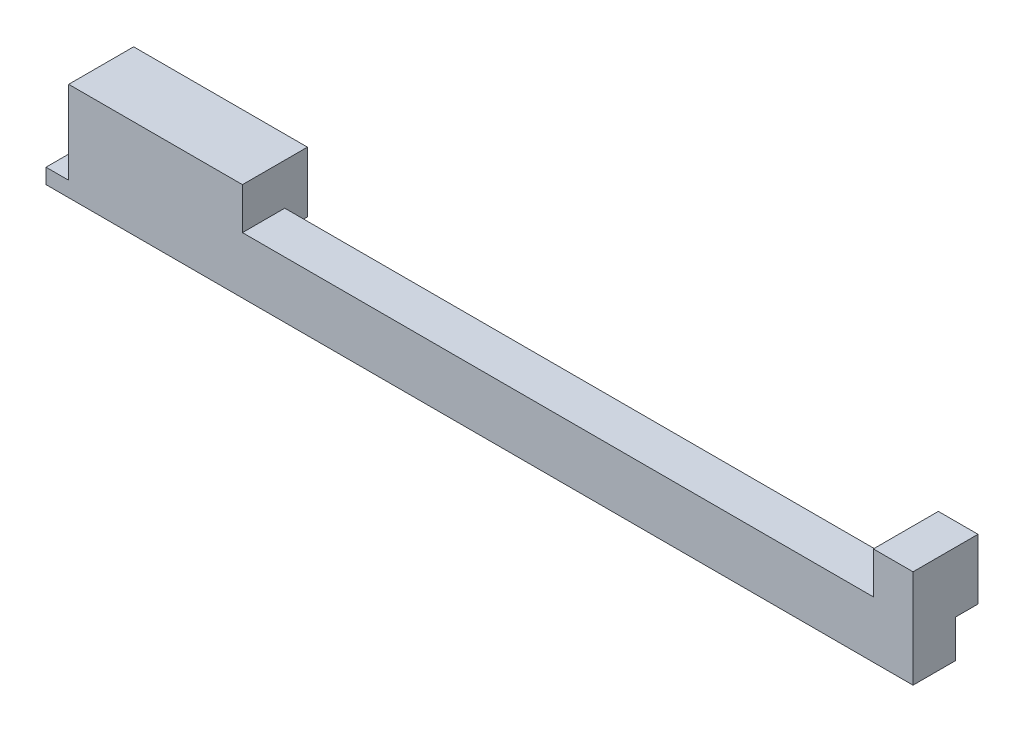
ISO-10303-21;
HEADER;
FILE_DESCRIPTION(('STEP AP214'),'2;1');
FILE_NAME('part.step','',(''),(''),'','','');
FILE_SCHEMA(('AUTOMOTIVE_DESIGN { 1 0 10303 214 1 1 1 1 }'));
ENDSEC;
DATA;
#1=APPLICATION_CONTEXT('core data for automotive mechanical design processes');
#2=APPLICATION_PROTOCOL_DEFINITION('international standard','automotive_design',2000,#1);
#3=PRODUCT_CONTEXT('',#1,'mechanical');
#4=PRODUCT('Part','Part','',(#3));
#5=PRODUCT_RELATED_PRODUCT_CATEGORY('part','',(#4));
#6=PRODUCT_DEFINITION_FORMATION('','',#4);
#7=PRODUCT_DEFINITION_CONTEXT('part definition',#1,'design');
#8=PRODUCT_DEFINITION('design','',#6,#7);
#9=PRODUCT_DEFINITION_SHAPE('','',#8);
#10=(LENGTH_UNIT() NAMED_UNIT(*) SI_UNIT(.MILLI.,.METRE.));
#11=(NAMED_UNIT(*) PLANE_ANGLE_UNIT() SI_UNIT($,.RADIAN.));
#12=(NAMED_UNIT(*) SI_UNIT($,.STERADIAN.) SOLID_ANGLE_UNIT());
#13=UNCERTAINTY_MEASURE_WITH_UNIT(LENGTH_MEASURE(1.E-05),#10,'distance_accuracy_value','');
#14=(GEOMETRIC_REPRESENTATION_CONTEXT(3) GLOBAL_UNCERTAINTY_ASSIGNED_CONTEXT((#13)) GLOBAL_UNIT_ASSIGNED_CONTEXT((#10,
#11,#12)) REPRESENTATION_CONTEXT('',''));
#15=CARTESIAN_POINT('',(0.,0.,0.));
#16=DIRECTION('',(0.,0.,1.));
#17=DIRECTION('',(1.,0.,0.));
#18=AXIS2_PLACEMENT_3D('',#15,#16,#17);
#19=CARTESIAN_POINT('',(0.,173.602166940836,0.));
#20=DIRECTION('',(0.,1.,0.));
#21=DIRECTION('',(0.,0.,1.));
#22=AXIS2_PLACEMENT_3D('',#19,#20,#21);
#23=PLANE('',#22);
#24=DIRECTION('',(1.,0.,0.));
#25=VECTOR('',#24,1.);
#26=CARTESIAN_POINT('',(-180.666732553835,173.602166940836,8.66482688049147));
#27=LINE('',#26,#25);
#28=CARTESIAN_POINT('',(-180.666732553835,173.602166940836,8.66482688049147));
#29=VERTEX_POINT('',#28);
#30=CARTESIAN_POINT('',(-175.666732553835,173.602166940836,8.66482688049147));
#31=VERTEX_POINT('',#30);
#32=EDGE_CURVE('E47',#29,#31,#27,.T.);
#33=ORIENTED_EDGE('',*,*,#32,.T.);
#34=DIRECTION('',(0.,0.,-1.));
#35=VECTOR('',#34,1.);
#36=CARTESIAN_POINT('',(-175.666732553834,173.602166940836,12.6648268804915));
#37=LINE('',#36,#35);
#38=CARTESIAN_POINT('',(-175.666732553834,173.602166940836,4.33149354715814));
#39=VERTEX_POINT('',#38);
#40=EDGE_CURVE('E52',#31,#39,#37,.T.);
#41=ORIENTED_EDGE('',*,*,#40,.T.);
#42=DIRECTION('',(-1.,0.,0.));
#43=VECTOR('',#42,1.);
#44=CARTESIAN_POINT('',(45.1666007794988,173.602166940836,4.33149354715814));
#45=LINE('',#44,#43);
#46=CARTESIAN_POINT('',(10.5832674461655,173.602166940836,4.33149354715814));
#47=VERTEX_POINT('',#46);
#48=EDGE_CURVE('E268',#47,#39,#45,.T.);
#49=ORIENTED_EDGE('',*,*,#48,.F.);
#50=DIRECTION('',(0.,0.,1.));
#51=VECTOR('',#50,1.);
#52=CARTESIAN_POINT('',(10.5832674461655,173.602166940836,4.33149354715814));
#53=LINE('',#52,#51);
#54=CARTESIAN_POINT('',(10.5832674461655,173.602166940836,13.6648268804915));
#55=VERTEX_POINT('',#54);
#56=EDGE_CURVE('E11',#47,#55,#53,.T.);
#57=ORIENTED_EDGE('',*,*,#56,.T.);
#58=DIRECTION('',(1.,0.,0.));
#59=VECTOR('',#58,1.);
#60=CARTESIAN_POINT('',(45.1666007794988,173.602166940836,13.6648268804915));
#61=LINE('',#60,#59);
#62=CARTESIAN_POINT('',(-180.666732553835,173.602166940836,13.6648268804915));
#63=VERTEX_POINT('',#62);
#64=EDGE_CURVE('E66',#63,#55,#61,.T.);
#65=ORIENTED_EDGE('',*,*,#64,.F.);
#66=DIRECTION('',(0.,0.,1.));
#67=VECTOR('',#66,1.);
#68=CARTESIAN_POINT('',(-180.666732553835,173.602166940836,12.6648268804915));
#69=LINE('',#68,#67);
#70=EDGE_CURVE('E270',#29,#63,#69,.T.);
#71=ORIENTED_EDGE('',*,*,#70,.F.);
#72=EDGE_LOOP('',(#33,#41,#49,#57,#65,#71));
#73=FACE_BOUND('',#72,.T.);
#74=ADVANCED_FACE('F44',(#73),#23,.F.);
#75=CARTESIAN_POINT('',(-67.7500658871679,-43.0644997258313,-0.668506452841859));
#76=DIRECTION('',(0.,0.,1.));
#77=DIRECTION('',(0.,-1.,0.));
#78=AXIS2_PLACEMENT_3D('',#75,#76,#77);
#79=PLANE('',#78);
#80=DIRECTION('',(-1.,0.,0.));
#81=VECTOR('',#80,1.);
#82=CARTESIAN_POINT('',(-67.7500658871679,181.935500274169,-0.668506452841859));
#83=LINE('',#82,#81);
#84=CARTESIAN_POINT('',(-137.333399220501,181.935500274169,-0.668506452841859));
#85=VERTEX_POINT('',#84);
#86=CARTESIAN_POINT('',(-173.746119425869,181.935500274169,-0.668506452841859));
#87=VERTEX_POINT('',#86);
#88=EDGE_CURVE('E239',#85,#87,#83,.T.);
#89=ORIENTED_EDGE('',*,*,#88,.T.);
#90=DIRECTION('',(-0.692646888854002,-0.721276845157858,0.));
#91=VECTOR('',#90,1.);
#92=CARTESIAN_POINT('',(-173.746119425869,181.935500274169,-0.668506452841859));
#93=LINE('',#92,#91);
#94=CARTESIAN_POINT('',(-175.666732553835,179.935500274169,-0.668506452841859));
#95=VERTEX_POINT('',#94);
#96=EDGE_CURVE('E295',#87,#95,#93,.T.);
#97=ORIENTED_EDGE('',*,*,#96,.T.);
#98=DIRECTION('',(0.,-1.,0.));
#99=VECTOR('',#98,1.);
#100=CARTESIAN_POINT('',(-175.666732553835,-43.0644997258311,-0.668506452841859));
#101=LINE('',#100,#99);
#102=CARTESIAN_POINT('',(-175.666732553835,195.268833607502,-0.668506452841859));
#103=VERTEX_POINT('',#102);
#104=EDGE_CURVE('E348',#103,#95,#101,.T.);
#105=ORIENTED_EDGE('',*,*,#104,.F.);
#106=DIRECTION('',(-1.,0.,0.));
#107=VECTOR('',#106,1.);
#108=CARTESIAN_POINT('',(-67.7500658871679,195.268833607502,-0.668506452841859));
#109=LINE('',#108,#107);
#110=CARTESIAN_POINT('',(-137.333399220501,195.268833607502,-0.668506452841859));
#111=VERTEX_POINT('',#110);
#112=EDGE_CURVE('E296',#111,#103,#109,.T.);
#113=ORIENTED_EDGE('',*,*,#112,.F.);
#114=DIRECTION('',(0.,1.,0.));
#115=VECTOR('',#114,1.);
#116=CARTESIAN_POINT('',(-137.333399220501,-43.0644997258313,-0.668506452841859));
#117=LINE('',#116,#115);
#118=EDGE_CURVE('E193',#85,#111,#117,.T.);
#119=ORIENTED_EDGE('',*,*,#118,.F.);
#120=EDGE_LOOP('',(#89,#97,#105,#113,#119));
#121=FACE_BOUND('',#120,.T.);
#122=ADVANCED_FACE('F349',(#121),#79,.F.);
#123=CARTESIAN_POINT('',(-180.666732553835,-43.0644997258311,8.66482688049147));
#124=DIRECTION('',(0.,0.,-1.));
#125=DIRECTION('',(0.,-1.,0.));
#126=AXIS2_PLACEMENT_3D('',#123,#124,#125);
#127=PLANE('',#126);
#128=ORIENTED_EDGE('',*,*,#32,.F.);
#129=DIRECTION('',(0.,-1.,0.));
#130=VECTOR('',#129,1.);
#131=CARTESIAN_POINT('',(-180.666732553835,176.935500274169,8.66482688049147));
#132=LINE('',#131,#130);
#133=CARTESIAN_POINT('',(-180.666732553835,176.935500274169,8.66482688049147));
#134=VERTEX_POINT('',#133);
#135=EDGE_CURVE('E249',#134,#29,#132,.T.);
#136=ORIENTED_EDGE('',*,*,#135,.F.);
#137=DIRECTION('',(-1.,0.,0.));
#138=VECTOR('',#137,1.);
#139=CARTESIAN_POINT('',(-180.666732553835,176.935500274169,8.66482688049147));
#140=LINE('',#139,#138);
#141=CARTESIAN_POINT('',(-175.666732553835,176.935500274169,8.66482688049147));
#142=VERTEX_POINT('',#141);
#143=EDGE_CURVE('E245',#142,#134,#140,.T.);
#144=ORIENTED_EDGE('',*,*,#143,.F.);
#145=DIRECTION('',(0.,1.,0.));
#146=VECTOR('',#145,1.);
#147=CARTESIAN_POINT('',(-175.666732553835,176.935500274169,8.66482688049147));
#148=LINE('',#147,#146);
#149=EDGE_CURVE('E225',#31,#142,#148,.T.);
#150=ORIENTED_EDGE('',*,*,#149,.F.);
#151=EDGE_LOOP('',(#128,#136,#144,#150));
#152=FACE_BOUND('',#151,.T.);
#153=ADVANCED_FACE('F283',(#152),#127,.T.);
#154=CARTESIAN_POINT('',(-180.666732553835,-43.0644997258311,12.6648268804915));
#155=DIRECTION('',(1.,0.,0.));
#156=DIRECTION('',(0.,1.,0.));
#157=AXIS2_PLACEMENT_3D('',#154,#155,#156);
#158=PLANE('',#157);
#159=ORIENTED_EDGE('',*,*,#135,.T.);
#160=ORIENTED_EDGE('',*,*,#70,.T.);
#161=DIRECTION('',(0.,-1.,0.));
#162=VECTOR('',#161,1.);
#163=CARTESIAN_POINT('',(-180.666732553835,-33.0644997258311,13.6648268804915));
#164=LINE('',#163,#162);
#165=CARTESIAN_POINT('',(-180.666732553835,176.935500274169,13.6648268804915));
#166=VERTEX_POINT('',#165);
#167=EDGE_CURVE('E324',#166,#63,#164,.T.);
#168=ORIENTED_EDGE('',*,*,#167,.F.);
#169=DIRECTION('',(0.,0.,-1.));
#170=VECTOR('',#169,1.);
#171=CARTESIAN_POINT('',(-180.666732553835,176.935500274169,12.6648268804915));
#172=LINE('',#171,#170);
#173=EDGE_CURVE('E217',#166,#134,#172,.T.);
#174=ORIENTED_EDGE('',*,*,#173,.T.);
#175=EDGE_LOOP('',(#159,#160,#168,#174));
#176=FACE_BOUND('',#175,.T.);
#177=ADVANCED_FACE('F370',(#176),#158,.F.);
#178=CARTESIAN_POINT('',(-180.666732553835,176.935500274169,12.6648268804915));
#179=DIRECTION('',(0.,-1.,0.));
#180=DIRECTION('',(0.,0.,-1.));
#181=AXIS2_PLACEMENT_3D('',#178,#179,#180);
#182=PLANE('',#181);
#183=ORIENTED_EDGE('',*,*,#143,.T.);
#184=ORIENTED_EDGE('',*,*,#173,.F.);
#185=DIRECTION('',(-1.,0.,0.));
#186=VECTOR('',#185,1.);
#187=CARTESIAN_POINT('',(-180.666732553835,176.935500274169,13.6648268804915));
#188=LINE('',#187,#186);
#189=CARTESIAN_POINT('',(-175.666732553835,176.935500274169,13.6648268804915));
#190=VERTEX_POINT('',#189);
#191=EDGE_CURVE('E248',#190,#166,#188,.T.);
#192=ORIENTED_EDGE('',*,*,#191,.F.);
#193=DIRECTION('',(0.,0.,-1.));
#194=VECTOR('',#193,1.);
#195=CARTESIAN_POINT('',(-175.666732553835,176.935500274169,12.6648268804915));
#196=LINE('',#195,#194);
#197=EDGE_CURVE('E220',#190,#142,#196,.T.);
#198=ORIENTED_EDGE('',*,*,#197,.T.);
#199=EDGE_LOOP('',(#183,#184,#192,#198));
#200=FACE_BOUND('',#199,.T.);
#201=ADVANCED_FACE('F372',(#200),#182,.F.);
#202=CARTESIAN_POINT('',(-180.666732553835,195.268833607502,12.6648268804915));
#203=DIRECTION('',(0.,-1.,0.));
#204=DIRECTION('',(0.,0.,-1.));
#205=AXIS2_PLACEMENT_3D('',#202,#203,#204);
#206=PLANE('',#205);
#207=DIRECTION('',(0.,0.,-1.));
#208=VECTOR('',#207,1.);
#209=CARTESIAN_POINT('',(-137.333399220501,195.268833607502,75.1807564618534));
#210=LINE('',#209,#208);
#211=CARTESIAN_POINT('',(-137.333399220501,195.268833607502,13.6648268804915));
#212=VERTEX_POINT('',#211);
#213=EDGE_CURVE('E305',#212,#111,#210,.T.);
#214=ORIENTED_EDGE('',*,*,#213,.T.);
#215=ORIENTED_EDGE('',*,*,#112,.T.);
#216=DIRECTION('',(0.,0.,-1.));
#217=VECTOR('',#216,1.);
#218=CARTESIAN_POINT('',(-175.666732553835,195.268833607502,12.6648268804915));
#219=LINE('',#218,#217);
#220=CARTESIAN_POINT('',(-175.666732553835,195.268833607502,13.6648268804915));
#221=VERTEX_POINT('',#220);
#222=EDGE_CURVE('E300',#221,#103,#219,.T.);
#223=ORIENTED_EDGE('',*,*,#222,.F.);
#224=DIRECTION('',(-1.,0.,0.));
#225=VECTOR('',#224,1.);
#226=CARTESIAN_POINT('',(-175.666732553835,195.268833607502,13.6648268804915));
#227=LINE('',#226,#225);
#228=EDGE_CURVE('E292',#212,#221,#227,.T.);
#229=ORIENTED_EDGE('',*,*,#228,.F.);
#230=EDGE_LOOP('',(#214,#215,#223,#229));
#231=FACE_BOUND('',#230,.T.);
#232=ADVANCED_FACE('F342',(#231),#206,.F.);
#233=CARTESIAN_POINT('',(-67.7500658871679,-43.0644997258313,-0.668506452841859));
#234=DIRECTION('',(0.,0.,1.));
#235=DIRECTION('',(0.,-1.,0.));
#236=AXIS2_PLACEMENT_3D('',#233,#234,#235);
#237=PLANE('',#236);
#238=DIRECTION('',(1.,0.,0.));
#239=VECTOR('',#238,1.);
#240=CARTESIAN_POINT('',(-67.7500658871679,195.268833607502,-0.668506452841859));
#241=LINE('',#240,#239);
#242=CARTESIAN_POINT('',(1.83326744616545,195.268833607502,-0.668506452841859));
#243=VERTEX_POINT('',#242);
#244=CARTESIAN_POINT('',(10.5832674461654,195.268833607502,-0.668506452841859));
#245=VERTEX_POINT('',#244);
#246=EDGE_CURVE('E230',#243,#245,#241,.T.);
#247=ORIENTED_EDGE('',*,*,#246,.T.);
#248=DIRECTION('',(0.,-1.,0.));
#249=VECTOR('',#248,1.);
#250=CARTESIAN_POINT('',(10.5832674461654,-43.0644997258313,-0.668506452841859));
#251=LINE('',#250,#249);
#252=CARTESIAN_POINT('',(10.5832674461655,181.935500274169,-0.668506452841859));
#253=VERTEX_POINT('',#252);
#254=EDGE_CURVE('E263',#245,#253,#251,.T.);
#255=ORIENTED_EDGE('',*,*,#254,.T.);
#256=DIRECTION('',(1.,0.,0.));
#257=VECTOR('',#256,1.);
#258=CARTESIAN_POINT('',(-67.7500658871679,181.935500274169,-0.668506452841859));
#259=LINE('',#258,#257);
#260=CARTESIAN_POINT('',(1.83326744616545,181.935500274169,-0.668506452841859));
#261=VERTEX_POINT('',#260);
#262=EDGE_CURVE('E301',#261,#253,#259,.T.);
#263=ORIENTED_EDGE('',*,*,#262,.F.);
#264=DIRECTION('',(0.,1.,0.));
#265=VECTOR('',#264,1.);
#266=CARTESIAN_POINT('',(1.83326744616545,-43.0644997258313,-0.668506452841859));
#267=LINE('',#266,#265);
#268=EDGE_CURVE('E228',#261,#243,#267,.T.);
#269=ORIENTED_EDGE('',*,*,#268,.T.);
#270=EDGE_LOOP('',(#247,#255,#263,#269));
#271=FACE_BOUND('',#270,.T.);
#272=ADVANCED_FACE('F394',(#271),#237,.F.);
#273=CARTESIAN_POINT('',(1.83326744616545,-43.0644997258311,75.1807564618534));
#274=DIRECTION('',(1.,0.,0.));
#275=DIRECTION('',(0.,0.,-1.));
#276=AXIS2_PLACEMENT_3D('',#273,#274,#275);
#277=PLANE('',#276);
#278=DIRECTION('',(0.,-1.,0.));
#279=VECTOR('',#278,1.);
#280=CARTESIAN_POINT('',(1.83326744616545,-43.0644997258311,4.33149354715814));
#281=LINE('',#280,#279);
#282=CARTESIAN_POINT('',(1.83326744616545,186.102166940836,4.33149354715814));
#283=VERTEX_POINT('',#282);
#284=CARTESIAN_POINT('',(1.83326744616545,181.935500274169,4.33149354715816));
#285=VERTEX_POINT('',#284);
#286=EDGE_CURVE('E204',#283,#285,#281,.T.);
#287=ORIENTED_EDGE('',*,*,#286,.F.);
#288=DIRECTION('',(0.,0.,-1.));
#289=VECTOR('',#288,1.);
#290=CARTESIAN_POINT('',(1.83326744616545,186.102166940836,13.6648268804915));
#291=LINE('',#290,#289);
#292=CARTESIAN_POINT('',(1.83326744616545,186.102166940836,13.6648268804915));
#293=VERTEX_POINT('',#292);
#294=EDGE_CURVE('E199',#293,#283,#291,.T.);
#295=ORIENTED_EDGE('',*,*,#294,.F.);
#296=DIRECTION('',(0.,-1.,0.));
#297=VECTOR('',#296,1.);
#298=CARTESIAN_POINT('',(1.83326744616545,188.602166940836,13.6648268804915));
#299=LINE('',#298,#297);
#300=CARTESIAN_POINT('',(1.83326744616545,195.268833607502,13.6648268804915));
#301=VERTEX_POINT('',#300);
#302=EDGE_CURVE('E227',#301,#293,#299,.T.);
#303=ORIENTED_EDGE('',*,*,#302,.F.);
#304=DIRECTION('',(0.,0.,-1.));
#305=VECTOR('',#304,1.);
#306=CARTESIAN_POINT('',(1.83326744616545,195.268833607502,75.1807564618534));
#307=LINE('',#306,#305);
#308=EDGE_CURVE('E250',#301,#243,#307,.T.);
#309=ORIENTED_EDGE('',*,*,#308,.T.);
#310=ORIENTED_EDGE('',*,*,#268,.F.);
#311=DIRECTION('',(0.,0.,-1.));
#312=VECTOR('',#311,1.);
#313=CARTESIAN_POINT('',(1.83326744616545,181.935500274169,75.1807564618534));
#314=LINE('',#313,#312);
#315=EDGE_CURVE('E254',#285,#261,#314,.T.);
#316=ORIENTED_EDGE('',*,*,#315,.F.);
#317=EDGE_LOOP('',(#287,#295,#303,#309,#310,#316));
#318=FACE_BOUND('',#317,.T.);
#319=ADVANCED_FACE('F390',(#318),#277,.F.);
#320=CARTESIAN_POINT('',(45.1666007794988,186.102166940836,4.33149354715814));
#321=DIRECTION('',(0.,-1.,0.));
#322=DIRECTION('',(0.,0.,-1.));
#323=AXIS2_PLACEMENT_3D('',#320,#321,#322);
#324=PLANE('',#323);
#325=DIRECTION('',(0.,0.,1.));
#326=VECTOR('',#325,1.);
#327=CARTESIAN_POINT('',(-137.333399220501,186.102166940836,13.6648268804915));
#328=LINE('',#327,#326);
#329=CARTESIAN_POINT('',(-137.333399220501,186.102166940836,4.33149354715814));
#330=VERTEX_POINT('',#329);
#331=CARTESIAN_POINT('',(-137.333399220501,186.102166940836,13.6648268804915));
#332=VERTEX_POINT('',#331);
#333=EDGE_CURVE('E183',#330,#332,#328,.T.);
#334=ORIENTED_EDGE('',*,*,#333,.T.);
#335=DIRECTION('',(1.,0.,0.));
#336=VECTOR('',#335,1.);
#337=CARTESIAN_POINT('',(-137.333399220501,186.102166940836,13.6648268804915));
#338=LINE('',#337,#336);
#339=EDGE_CURVE('E258',#332,#293,#338,.T.);
#340=ORIENTED_EDGE('',*,*,#339,.T.);
#341=ORIENTED_EDGE('',*,*,#294,.T.);
#342=DIRECTION('',(-1.,0.,0.));
#343=VECTOR('',#342,1.);
#344=CARTESIAN_POINT('',(-137.333399220501,186.102166940836,4.33149354715814));
#345=LINE('',#344,#343);
#346=EDGE_CURVE('E196',#283,#330,#345,.T.);
#347=ORIENTED_EDGE('',*,*,#346,.T.);
#348=EDGE_LOOP('',(#334,#340,#341,#347));
#349=FACE_BOUND('',#348,.T.);
#350=ADVANCED_FACE('F197',(#349),#324,.F.);
#351=CARTESIAN_POINT('',(-137.333399220501,-43.0644997258311,75.1807564618534));
#352=DIRECTION('',(-1.,0.,0.));
#353=DIRECTION('',(0.,0.,1.));
#354=AXIS2_PLACEMENT_3D('',#351,#352,#353);
#355=PLANE('',#354);
#356=ORIENTED_EDGE('',*,*,#333,.F.);
#357=DIRECTION('',(0.,-1.,0.));
#358=VECTOR('',#357,1.);
#359=CARTESIAN_POINT('',(-137.333399220501,-43.0644997258311,4.33149354715814));
#360=LINE('',#359,#358);
#361=CARTESIAN_POINT('',(-137.333399220501,181.935500274169,4.33149354715816));
#362=VERTEX_POINT('',#361);
#363=EDGE_CURVE('E188',#330,#362,#360,.T.);
#364=ORIENTED_EDGE('',*,*,#363,.T.);
#365=DIRECTION('',(0.,0.,-1.));
#366=VECTOR('',#365,1.);
#367=CARTESIAN_POINT('',(-137.333399220501,181.935500274169,75.1807564618534));
#368=LINE('',#367,#366);
#369=EDGE_CURVE('E243',#362,#85,#368,.T.);
#370=ORIENTED_EDGE('',*,*,#369,.T.);
#371=ORIENTED_EDGE('',*,*,#118,.T.);
#372=ORIENTED_EDGE('',*,*,#213,.F.);
#373=DIRECTION('',(0.,1.,0.));
#374=VECTOR('',#373,1.);
#375=CARTESIAN_POINT('',(-137.333399220501,195.268833607502,13.6648268804915));
#376=LINE('',#375,#374);
#377=EDGE_CURVE('E190',#332,#212,#376,.T.);
#378=ORIENTED_EDGE('',*,*,#377,.F.);
#379=EDGE_LOOP('',(#356,#364,#370,#371,#372,#378));
#380=FACE_BOUND('',#379,.T.);
#381=ADVANCED_FACE('F185',(#380),#355,.F.);
#382=CARTESIAN_POINT('',(-67.7500658871679,181.935500274169,4.33149354715814));
#383=DIRECTION('',(0.,-1.,0.));
#384=DIRECTION('',(-1.,0.,0.));
#385=AXIS2_PLACEMENT_3D('',#382,#383,#384);
#386=PLANE('',#385);
#387=ORIENTED_EDGE('',*,*,#88,.F.);
#388=ORIENTED_EDGE('',*,*,#369,.F.);
#389=DIRECTION('',(-1.,0.,0.));
#390=VECTOR('',#389,1.);
#391=CARTESIAN_POINT('',(-67.7500658871679,181.935500274169,4.33149354715814));
#392=LINE('',#391,#390);
#393=CARTESIAN_POINT('',(-173.746119425869,181.935500274169,4.33149354715814));
#394=VERTEX_POINT('',#393);
#395=EDGE_CURVE('E211',#362,#394,#392,.T.);
#396=ORIENTED_EDGE('',*,*,#395,.T.);
#397=DIRECTION('',(0.,0.,1.));
#398=VECTOR('',#397,1.);
#399=CARTESIAN_POINT('',(-173.746119425869,181.935500274169,-3.44136685093544));
#400=LINE('',#399,#398);
#401=EDGE_CURVE('E321',#87,#394,#400,.T.);
#402=ORIENTED_EDGE('',*,*,#401,.F.);
#403=EDGE_LOOP('',(#387,#388,#396,#402));
#404=FACE_BOUND('',#403,.T.);
#405=ADVANCED_FACE('F377',(#404),#386,.T.);
#406=CARTESIAN_POINT('',(-173.746119425869,181.935500274169,-3.44136685093544));
#407=DIRECTION('',(-0.721276845157858,0.692646888854002,0.));
#408=DIRECTION('',(0.,0.,1.));
#409=AXIS2_PLACEMENT_3D('',#406,#407,#408);
#410=PLANE('',#409);
#411=ORIENTED_EDGE('',*,*,#401,.T.);
#412=DIRECTION('',(0.692646888854002,0.721276845157858,0.));
#413=VECTOR('',#412,1.);
#414=CARTESIAN_POINT('',(-173.746119425869,181.935500274169,4.33149354715814));
#415=LINE('',#414,#413);
#416=CARTESIAN_POINT('',(-175.666732553835,179.935500274169,4.33149354715814));
#417=VERTEX_POINT('',#416);
#418=EDGE_CURVE('E235',#417,#394,#415,.T.);
#419=ORIENTED_EDGE('',*,*,#418,.F.);
#420=DIRECTION('',(0.,0.,1.));
#421=VECTOR('',#420,1.);
#422=CARTESIAN_POINT('',(-175.666732553835,179.935500274169,-3.44136685093544));
#423=LINE('',#422,#421);
#424=EDGE_CURVE('E244',#95,#417,#423,.T.);
#425=ORIENTED_EDGE('',*,*,#424,.F.);
#426=ORIENTED_EDGE('',*,*,#96,.F.);
#427=EDGE_LOOP('',(#411,#419,#425,#426));
#428=FACE_BOUND('',#427,.T.);
#429=ADVANCED_FACE('F380',(#428),#410,.F.);
#430=CARTESIAN_POINT('',(-175.666732553835,-43.0644997258311,12.6648268804915));
#431=DIRECTION('',(-1.,0.,0.));
#432=DIRECTION('',(0.,0.,1.));
#433=AXIS2_PLACEMENT_3D('',#430,#431,#432);
#434=PLANE('',#433);
#435=ORIENTED_EDGE('',*,*,#40,.F.);
#436=ORIENTED_EDGE('',*,*,#149,.T.);
#437=ORIENTED_EDGE('',*,*,#197,.F.);
#438=DIRECTION('',(0.,-1.,0.));
#439=VECTOR('',#438,1.);
#440=CARTESIAN_POINT('',(-175.666732553835,176.935500274169,13.6648268804915));
#441=LINE('',#440,#439);
#442=EDGE_CURVE('E224',#221,#190,#441,.T.);
#443=ORIENTED_EDGE('',*,*,#442,.F.);
#444=ORIENTED_EDGE('',*,*,#222,.T.);
#445=ORIENTED_EDGE('',*,*,#104,.T.);
#446=ORIENTED_EDGE('',*,*,#424,.T.);
#447=DIRECTION('',(0.,-1.,0.));
#448=VECTOR('',#447,1.);
#449=CARTESIAN_POINT('',(-175.666732553835,-43.0644997258311,4.33149354715814));
#450=LINE('',#449,#448);
#451=EDGE_CURVE('E238',#417,#39,#450,.T.);
#452=ORIENTED_EDGE('',*,*,#451,.T.);
#453=EDGE_LOOP('',(#435,#436,#437,#443,#444,#445,#446,#452));
#454=FACE_BOUND('',#453,.T.);
#455=ADVANCED_FACE('F353',(#454),#434,.T.);
#456=CARTESIAN_POINT('',(-67.7500658871679,181.935500274169,4.33149354715814));
#457=DIRECTION('',(0.,-1.,0.));
#458=DIRECTION('',(0.,0.,-1.));
#459=AXIS2_PLACEMENT_3D('',#456,#457,#458);
#460=PLANE('',#459);
#461=DIRECTION('',(0.,0.,-1.));
#462=VECTOR('',#461,1.);
#463=CARTESIAN_POINT('',(10.5832674461655,181.935500274169,4.33149354715814));
#464=LINE('',#463,#462);
#465=CARTESIAN_POINT('',(10.5832674461654,181.935500274169,4.33149354715814));
#466=VERTEX_POINT('',#465);
#467=EDGE_CURVE('E259',#466,#253,#464,.T.);
#468=ORIENTED_EDGE('',*,*,#467,.F.);
#469=DIRECTION('',(1.,0.,0.));
#470=VECTOR('',#469,1.);
#471=CARTESIAN_POINT('',(-67.7500658871679,181.935500274169,4.33149354715814));
#472=LINE('',#471,#470);
#473=EDGE_CURVE('E311',#285,#466,#472,.T.);
#474=ORIENTED_EDGE('',*,*,#473,.F.);
#475=ORIENTED_EDGE('',*,*,#315,.T.);
#476=ORIENTED_EDGE('',*,*,#262,.T.);
#477=EDGE_LOOP('',(#468,#474,#475,#476));
#478=FACE_BOUND('',#477,.T.);
#479=ADVANCED_FACE('F398',(#478),#460,.T.);
#480=CARTESIAN_POINT('',(45.1666007794988,-43.0644997258311,4.33149354715814));
#481=DIRECTION('',(0.,0.,1.));
#482=DIRECTION('',(1.,0.,0.));
#483=AXIS2_PLACEMENT_3D('',#480,#481,#482);
#484=PLANE('',#483);
#485=DIRECTION('',(0.,-1.,0.));
#486=VECTOR('',#485,1.);
#487=CARTESIAN_POINT('',(10.5832674461654,-43.0644997258311,4.33149354715814));
#488=LINE('',#487,#486);
#489=EDGE_CURVE('E255',#466,#47,#488,.T.);
#490=ORIENTED_EDGE('',*,*,#489,.T.);
#491=ORIENTED_EDGE('',*,*,#48,.T.);
#492=ORIENTED_EDGE('',*,*,#451,.F.);
#493=ORIENTED_EDGE('',*,*,#418,.T.);
#494=ORIENTED_EDGE('',*,*,#395,.F.);
#495=ORIENTED_EDGE('',*,*,#363,.F.);
#496=ORIENTED_EDGE('',*,*,#346,.F.);
#497=ORIENTED_EDGE('',*,*,#286,.T.);
#498=ORIENTED_EDGE('',*,*,#473,.T.);
#499=EDGE_LOOP('',(#490,#491,#492,#493,#494,#495,#496,#497,#498));
#500=FACE_BOUND('',#499,.T.);
#501=ADVANCED_FACE('F208',(#500),#484,.F.);
#502=CARTESIAN_POINT('',(45.1666007794988,-43.0644997258311,13.6648268804915));
#503=DIRECTION('',(0.,0.,-1.));
#504=DIRECTION('',(0.,-1.,0.));
#505=AXIS2_PLACEMENT_3D('',#502,#503,#504);
#506=PLANE('',#505);
#507=ORIENTED_EDGE('',*,*,#167,.T.);
#508=ORIENTED_EDGE('',*,*,#64,.T.);
#509=DIRECTION('',(0.,1.,0.));
#510=VECTOR('',#509,1.);
#511=CARTESIAN_POINT('',(10.5832674461654,-43.0644997258311,13.6648268804915));
#512=LINE('',#511,#510);
#513=CARTESIAN_POINT('',(10.5832674461655,195.268833607502,13.6648268804915));
#514=VERTEX_POINT('',#513);
#515=EDGE_CURVE('E262',#55,#514,#512,.T.);
#516=ORIENTED_EDGE('',*,*,#515,.T.);
#517=DIRECTION('',(-1.,0.,0.));
#518=VECTOR('',#517,1.);
#519=CARTESIAN_POINT('',(1.83326744616545,195.268833607502,13.6648268804915));
#520=LINE('',#519,#518);
#521=EDGE_CURVE('E234',#514,#301,#520,.T.);
#522=ORIENTED_EDGE('',*,*,#521,.T.);
#523=ORIENTED_EDGE('',*,*,#302,.T.);
#524=ORIENTED_EDGE('',*,*,#339,.F.);
#525=ORIENTED_EDGE('',*,*,#377,.T.);
#526=ORIENTED_EDGE('',*,*,#228,.T.);
#527=ORIENTED_EDGE('',*,*,#442,.T.);
#528=ORIENTED_EDGE('',*,*,#191,.T.);
#529=EDGE_LOOP('',(#507,#508,#516,#522,#523,#524,#525,#526,#527,#528));
#530=FACE_BOUND('',#529,.T.);
#531=ADVANCED_FACE('F373',(#530),#506,.F.);
#532=CARTESIAN_POINT('',(45.1666007794988,195.268833607502,12.6648268804915));
#533=DIRECTION('',(0.,-1.,0.));
#534=DIRECTION('',(0.,0.,-1.));
#535=AXIS2_PLACEMENT_3D('',#532,#533,#534);
#536=PLANE('',#535);
#537=ORIENTED_EDGE('',*,*,#521,.F.);
#538=DIRECTION('',(0.,0.,-1.));
#539=VECTOR('',#538,1.);
#540=CARTESIAN_POINT('',(10.5832674461655,195.268833607502,12.6648268804915));
#541=LINE('',#540,#539);
#542=EDGE_CURVE('E257',#514,#245,#541,.T.);
#543=ORIENTED_EDGE('',*,*,#542,.T.);
#544=ORIENTED_EDGE('',*,*,#246,.F.);
#545=ORIENTED_EDGE('',*,*,#308,.F.);
#546=EDGE_LOOP('',(#537,#543,#544,#545));
#547=FACE_BOUND('',#546,.T.);
#548=ADVANCED_FACE('F392',(#547),#536,.F.);
#549=CARTESIAN_POINT('',(10.5832674461654,-43.0644997258311,4.33149354715814));
#550=DIRECTION('',(1.,0.,0.));
#551=DIRECTION('',(0.,-1.,0.));
#552=AXIS2_PLACEMENT_3D('',#549,#550,#551);
#553=PLANE('',#552);
#554=ORIENTED_EDGE('',*,*,#56,.F.);
#555=ORIENTED_EDGE('',*,*,#489,.F.);
#556=ORIENTED_EDGE('',*,*,#467,.T.);
#557=ORIENTED_EDGE('',*,*,#254,.F.);
#558=ORIENTED_EDGE('',*,*,#542,.F.);
#559=ORIENTED_EDGE('',*,*,#515,.F.);
#560=EDGE_LOOP('',(#554,#555,#556,#557,#558,#559));
#561=FACE_BOUND('',#560,.T.);
#562=ADVANCED_FACE('F383',(#561),#553,.T.);
#563=CLOSED_SHELL('',(#74,#122,#153,#177,#201,#232,#272,#319,#350,#381,#405,#429,#455,#479,#501,
#531,#548,#562));
#564=MANIFOLD_SOLID_BREP('B2',#563);
#565=ADVANCED_BREP_SHAPE_REPRESENTATION('',(#18,#564),#14);
#566=SHAPE_DEFINITION_REPRESENTATION(#9,#565);
ENDSEC;
END-ISO-10303-21;
